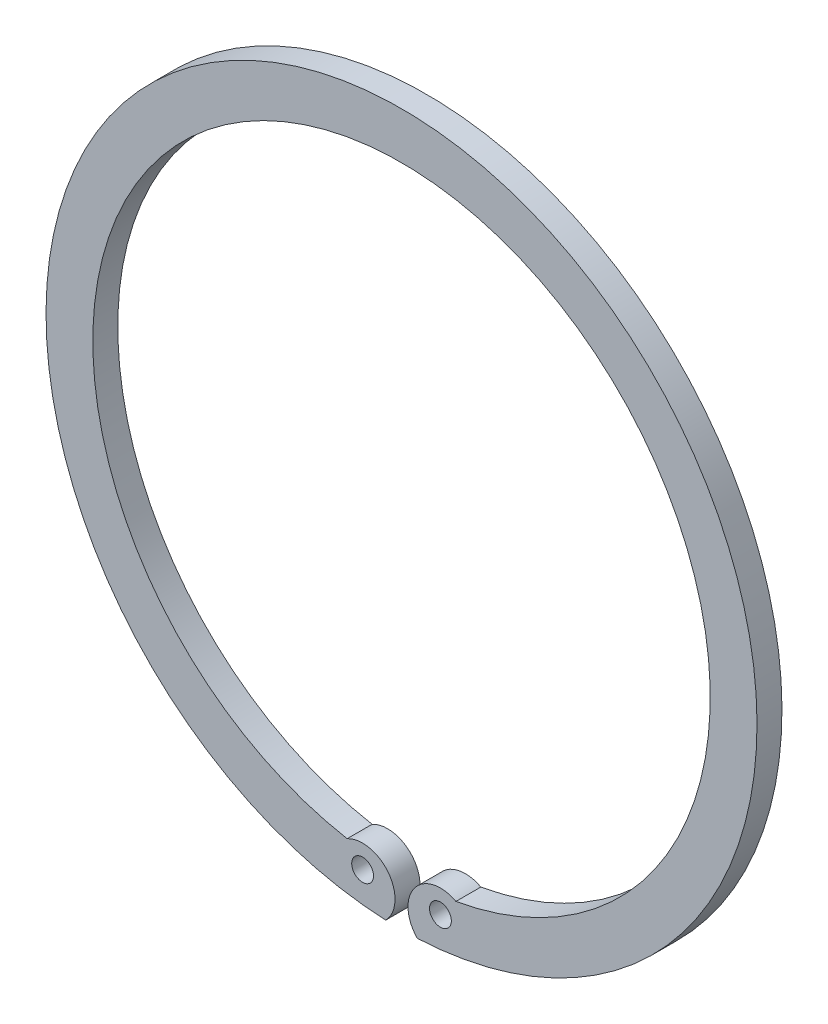
ISO-10303-21;
HEADER;
FILE_DESCRIPTION(('STEP AP214'),'2;1');
FILE_NAME('part.step','',(''),(''),'','','');
FILE_SCHEMA(('AUTOMOTIVE_DESIGN { 1 0 10303 214 1 1 1 1 }'));
ENDSEC;
DATA;
#1=APPLICATION_CONTEXT('core data for automotive mechanical design processes');
#2=APPLICATION_PROTOCOL_DEFINITION('international standard','automotive_design',2000,#1);
#3=PRODUCT_CONTEXT('',#1,'mechanical');
#4=PRODUCT('Part','Part','',(#3));
#5=PRODUCT_RELATED_PRODUCT_CATEGORY('part','',(#4));
#6=PRODUCT_DEFINITION_FORMATION('','',#4);
#7=PRODUCT_DEFINITION_CONTEXT('part definition',#1,'design');
#8=PRODUCT_DEFINITION('design','',#6,#7);
#9=PRODUCT_DEFINITION_SHAPE('','',#8);
#10=(LENGTH_UNIT() NAMED_UNIT(*) SI_UNIT(.MILLI.,.METRE.));
#11=(NAMED_UNIT(*) PLANE_ANGLE_UNIT() SI_UNIT($,.RADIAN.));
#12=(NAMED_UNIT(*) SI_UNIT($,.STERADIAN.) SOLID_ANGLE_UNIT());
#13=UNCERTAINTY_MEASURE_WITH_UNIT(LENGTH_MEASURE(1.E-05),#10,'distance_accuracy_value','');
#14=(GEOMETRIC_REPRESENTATION_CONTEXT(3) GLOBAL_UNCERTAINTY_ASSIGNED_CONTEXT((#13)) GLOBAL_UNIT_ASSIGNED_CONTEXT((#10,
#11,#12)) REPRESENTATION_CONTEXT('',''));
#15=CARTESIAN_POINT('',(0.,0.,0.));
#16=DIRECTION('',(0.,0.,1.));
#17=DIRECTION('',(1.,0.,0.));
#18=AXIS2_PLACEMENT_3D('',#15,#16,#17);
#19=CARTESIAN_POINT('',(6.24,-51.8,2.));
#20=DIRECTION('',(0.,0.,-1.));
#21=DIRECTION('',(1.,0.,0.));
#22=AXIS2_PLACEMENT_3D('',#19,#20,#21);
#23=CYLINDRICAL_SURFACE('',#22,1.75);
#24=CARTESIAN_POINT('',(6.24,-51.8,0.));
#25=DIRECTION('',(0.,0.,1.));
#26=DIRECTION('',(1.,0.,0.));
#27=AXIS2_PLACEMENT_3D('',#24,#25,#26);
#28=CIRCLE('',#27,1.75);
#29=CARTESIAN_POINT('',(4.49,-51.8,0.));
#30=VERTEX_POINT('',#29);
#31=EDGE_CURVE('E33',#30,#30,#28,.T.);
#32=ORIENTED_EDGE('',*,*,#31,.F.);
#33=EDGE_LOOP('',(#32));
#34=FACE_BOUND('',#33,.T.);
#35=CARTESIAN_POINT('',(6.24,-51.8,4.));
#36=DIRECTION('',(0.,0.,-1.));
#37=DIRECTION('',(1.,0.,0.));
#38=AXIS2_PLACEMENT_3D('',#35,#36,#37);
#39=CIRCLE('',#38,1.75);
#40=CARTESIAN_POINT('',(4.49,-51.8,4.));
#41=VERTEX_POINT('',#40);
#42=EDGE_CURVE('E26',#41,#41,#39,.T.);
#43=ORIENTED_EDGE('',*,*,#42,.F.);
#44=EDGE_LOOP('',(#43));
#45=FACE_BOUND('',#44,.T.);
#46=ADVANCED_FACE('F16',(#34,#45),#23,.F.);
#47=CARTESIAN_POINT('',(-6.24,-51.8,2.));
#48=DIRECTION('',(0.,0.,-1.));
#49=DIRECTION('',(1.,0.,0.));
#50=AXIS2_PLACEMENT_3D('',#47,#48,#49);
#51=CYLINDRICAL_SURFACE('',#50,1.75);
#52=CARTESIAN_POINT('',(-6.24,-51.8,0.));
#53=DIRECTION('',(0.,0.,1.));
#54=DIRECTION('',(1.,0.,0.));
#55=AXIS2_PLACEMENT_3D('',#52,#53,#54);
#56=CIRCLE('',#55,1.75);
#57=CARTESIAN_POINT('',(-7.99,-51.8,0.));
#58=VERTEX_POINT('',#57);
#59=EDGE_CURVE('E105',#58,#58,#56,.T.);
#60=ORIENTED_EDGE('',*,*,#59,.F.);
#61=EDGE_LOOP('',(#60));
#62=FACE_BOUND('',#61,.T.);
#63=CARTESIAN_POINT('',(-6.24,-51.8,4.));
#64=DIRECTION('',(0.,0.,-1.));
#65=DIRECTION('',(1.,0.,0.));
#66=AXIS2_PLACEMENT_3D('',#63,#64,#65);
#67=CIRCLE('',#66,1.75);
#68=CARTESIAN_POINT('',(-7.99,-51.8,4.));
#69=VERTEX_POINT('',#68);
#70=EDGE_CURVE('E101',#69,#69,#67,.T.);
#71=ORIENTED_EDGE('',*,*,#70,.F.);
#72=EDGE_LOOP('',(#71));
#73=FACE_BOUND('',#72,.T.);
#74=ADVANCED_FACE('F129',(#62,#73),#51,.F.);
#75=CARTESIAN_POINT('',(6.24,-53.3,2.));
#76=DIRECTION('',(0.,0.,1.));
#77=DIRECTION('',(-1.,0.,0.));
#78=AXIS2_PLACEMENT_3D('',#75,#76,#77);
#79=CYLINDRICAL_SURFACE('',#78,5.2);
#80=DIRECTION('',(0.,0.,1.));
#81=VECTOR('',#80,1.);
#82=CARTESIAN_POINT('',(8.71500065982332,-48.7267766582121,2.));
#83=LINE('',#82,#81);
#84=CARTESIAN_POINT('',(8.71500065982334,-48.7267766582121,0.));
#85=VERTEX_POINT('',#84);
#86=CARTESIAN_POINT('',(8.71500065982332,-48.7267766582121,4.));
#87=VERTEX_POINT('',#86);
#88=EDGE_CURVE('E86',#85,#87,#83,.T.);
#89=ORIENTED_EDGE('',*,*,#88,.F.);
#90=CARTESIAN_POINT('',(6.24,-53.3,0.));
#91=DIRECTION('',(0.,0.,-1.));
#92=DIRECTION('',(-1.,0.,0.));
#93=AXIS2_PLACEMENT_3D('',#90,#91,#92);
#94=CIRCLE('',#93,5.2);
#95=CARTESIAN_POINT('',(2.53020066523321,-56.9438151566406,0.));
#96=VERTEX_POINT('',#95);
#97=EDGE_CURVE('E20',#96,#85,#94,.T.);
#98=ORIENTED_EDGE('',*,*,#97,.F.);
#99=DIRECTION('',(0.,0.,1.));
#100=VECTOR('',#99,1.);
#101=CARTESIAN_POINT('',(2.53020066523321,-56.9438151566406,2.));
#102=LINE('',#101,#100);
#103=CARTESIAN_POINT('',(2.5302006652332,-56.9438151566406,4.));
#104=VERTEX_POINT('',#103);
#105=EDGE_CURVE('E11',#96,#104,#102,.T.);
#106=ORIENTED_EDGE('',*,*,#105,.T.);
#107=CARTESIAN_POINT('',(6.24,-53.3,4.));
#108=DIRECTION('',(0.,0.,1.));
#109=DIRECTION('',(-1.,0.,0.));
#110=AXIS2_PLACEMENT_3D('',#107,#108,#109);
#111=CIRCLE('',#110,5.2);
#112=EDGE_CURVE('E61',#87,#104,#111,.T.);
#113=ORIENTED_EDGE('',*,*,#112,.F.);
#114=EDGE_LOOP('',(#89,#98,#106,#113));
#115=FACE_BOUND('',#114,.T.);
#116=ADVANCED_FACE('F125',(#115),#79,.T.);
#117=CARTESIAN_POINT('',(0.,0.,4.));
#118=DIRECTION('',(0.,0.,1.));
#119=DIRECTION('',(1.,0.,0.));
#120=AXIS2_PLACEMENT_3D('',#117,#118,#119);
#121=PLANE('',#120);
#122=ORIENTED_EDGE('',*,*,#42,.T.);
#123=EDGE_LOOP('',(#122));
#124=FACE_BOUND('',#123,.T.);
#125=ORIENTED_EDGE('',*,*,#70,.T.);
#126=EDGE_LOOP('',(#125));
#127=FACE_BOUND('',#126,.T.);
#128=CARTESIAN_POINT('',(0.,0.,4.));
#129=DIRECTION('',(0.,0.,-1.));
#130=DIRECTION('',(1.,0.,0.));
#131=AXIS2_PLACEMENT_3D('',#128,#129,#130);
#132=CIRCLE('',#131,49.5);
#133=CARTESIAN_POINT('',(-8.71500065982332,-48.7267766582121,4.));
#134=VERTEX_POINT('',#133);
#135=EDGE_CURVE('E83',#134,#87,#132,.T.);
#136=ORIENTED_EDGE('',*,*,#135,.T.);
#137=ORIENTED_EDGE('',*,*,#112,.T.);
#138=CARTESIAN_POINT('',(0.,0.,4.));
#139=DIRECTION('',(0.,0.,1.));
#140=DIRECTION('',(1.,0.,0.));
#141=AXIS2_PLACEMENT_3D('',#138,#139,#140);
#142=CIRCLE('',#141,57.);
#143=CARTESIAN_POINT('',(-2.53020066523321,-56.9438151566406,4.));
#144=VERTEX_POINT('',#143);
#145=EDGE_CURVE('E99',#104,#144,#142,.T.);
#146=ORIENTED_EDGE('',*,*,#145,.T.);
#147=CARTESIAN_POINT('',(-6.24,-53.3,4.));
#148=DIRECTION('',(0.,0.,1.));
#149=DIRECTION('',(1.,0.,0.));
#150=AXIS2_PLACEMENT_3D('',#147,#148,#149);
#151=CIRCLE('',#150,5.2);
#152=EDGE_CURVE('E104',#144,#134,#151,.T.);
#153=ORIENTED_EDGE('',*,*,#152,.T.);
#154=EDGE_LOOP('',(#136,#137,#146,#153));
#155=FACE_BOUND('',#154,.T.);
#156=ADVANCED_FACE('F18',(#124,#127,#155),#121,.T.);
#157=CARTESIAN_POINT('',(0.,0.,2.));
#158=DIRECTION('',(0.,0.,-1.));
#159=DIRECTION('',(1.,0.,0.));
#160=AXIS2_PLACEMENT_3D('',#157,#158,#159);
#161=CYLINDRICAL_SURFACE('',#160,57.);
#162=ORIENTED_EDGE('',*,*,#145,.F.);
#163=ORIENTED_EDGE('',*,*,#105,.F.);
#164=CARTESIAN_POINT('',(0.,0.,0.));
#165=DIRECTION('',(0.,0.,-1.));
#166=DIRECTION('',(-1.,0.,0.));
#167=AXIS2_PLACEMENT_3D('',#164,#165,#166);
#168=CIRCLE('',#167,57.);
#169=CARTESIAN_POINT('',(-2.53020066523321,-56.9438151566406,0.));
#170=VERTEX_POINT('',#169);
#171=EDGE_CURVE('E71',#170,#96,#168,.T.);
#172=ORIENTED_EDGE('',*,*,#171,.F.);
#173=DIRECTION('',(0.,0.,-1.));
#174=VECTOR('',#173,1.);
#175=CARTESIAN_POINT('',(-2.53020066523321,-56.9438151566406,2.));
#176=LINE('',#175,#174);
#177=EDGE_CURVE('E91',#144,#170,#176,.T.);
#178=ORIENTED_EDGE('',*,*,#177,.F.);
#179=EDGE_LOOP('',(#162,#163,#172,#178));
#180=FACE_BOUND('',#179,.T.);
#181=ADVANCED_FACE('F116',(#180),#161,.T.);
#182=CARTESIAN_POINT('',(-6.24,-53.3,2.));
#183=DIRECTION('',(0.,0.,-1.));
#184=DIRECTION('',(1.,0.,0.));
#185=AXIS2_PLACEMENT_3D('',#182,#183,#184);
#186=CYLINDRICAL_SURFACE('',#185,5.2);
#187=DIRECTION('',(0.,0.,-1.));
#188=VECTOR('',#187,1.);
#189=CARTESIAN_POINT('',(-8.71500065982332,-48.7267766582121,2.));
#190=LINE('',#189,#188);
#191=CARTESIAN_POINT('',(-8.71500065982332,-48.7267766582121,0.));
#192=VERTEX_POINT('',#191);
#193=EDGE_CURVE('E78',#134,#192,#190,.T.);
#194=ORIENTED_EDGE('',*,*,#193,.F.);
#195=ORIENTED_EDGE('',*,*,#152,.F.);
#196=ORIENTED_EDGE('',*,*,#177,.T.);
#197=CARTESIAN_POINT('',(-6.24,-53.3,0.));
#198=DIRECTION('',(0.,0.,-1.));
#199=DIRECTION('',(1.,0.,0.));
#200=AXIS2_PLACEMENT_3D('',#197,#198,#199);
#201=CIRCLE('',#200,5.2);
#202=EDGE_CURVE('E89',#192,#170,#201,.T.);
#203=ORIENTED_EDGE('',*,*,#202,.F.);
#204=EDGE_LOOP('',(#194,#195,#196,#203));
#205=FACE_BOUND('',#204,.T.);
#206=ADVANCED_FACE('F90',(#205),#186,.T.);
#207=CARTESIAN_POINT('',(0.,0.,0.));
#208=DIRECTION('',(0.,0.,-1.));
#209=DIRECTION('',(-1.,0.,0.));
#210=AXIS2_PLACEMENT_3D('',#207,#208,#209);
#211=PLANE('',#210);
#212=ORIENTED_EDGE('',*,*,#31,.T.);
#213=EDGE_LOOP('',(#212));
#214=FACE_BOUND('',#213,.T.);
#215=ORIENTED_EDGE('',*,*,#59,.T.);
#216=EDGE_LOOP('',(#215));
#217=FACE_BOUND('',#216,.T.);
#218=ORIENTED_EDGE('',*,*,#171,.T.);
#219=ORIENTED_EDGE('',*,*,#97,.T.);
#220=CARTESIAN_POINT('',(0.,0.,0.));
#221=DIRECTION('',(0.,0.,1.));
#222=DIRECTION('',(1.,0.,0.));
#223=AXIS2_PLACEMENT_3D('',#220,#221,#222);
#224=CIRCLE('',#223,49.5);
#225=EDGE_CURVE('E82',#85,#192,#224,.T.);
#226=ORIENTED_EDGE('',*,*,#225,.T.);
#227=ORIENTED_EDGE('',*,*,#202,.T.);
#228=EDGE_LOOP('',(#218,#219,#226,#227));
#229=FACE_BOUND('',#228,.T.);
#230=ADVANCED_FACE('F94',(#214,#217,#229),#211,.T.);
#231=CARTESIAN_POINT('',(0.,0.,-4.));
#232=DIRECTION('',(0.,0.,-1.));
#233=DIRECTION('',(1.,0.,0.));
#234=AXIS2_PLACEMENT_3D('',#231,#232,#233);
#235=CYLINDRICAL_SURFACE('',#234,49.5);
#236=ORIENTED_EDGE('',*,*,#88,.T.);
#237=ORIENTED_EDGE('',*,*,#135,.F.);
#238=ORIENTED_EDGE('',*,*,#193,.T.);
#239=ORIENTED_EDGE('',*,*,#225,.F.);
#240=EDGE_LOOP('',(#236,#237,#238,#239));
#241=FACE_BOUND('',#240,.T.);
#242=ADVANCED_FACE('F80',(#241),#235,.F.);
#243=CLOSED_SHELL('',(#46,#74,#116,#156,#181,#206,#230,#242));
#244=MANIFOLD_SOLID_BREP('B1',#243);
#245=ADVANCED_BREP_SHAPE_REPRESENTATION('',(#18,#244),#14);
#246=SHAPE_DEFINITION_REPRESENTATION(#9,#245);
ENDSEC;
END-ISO-10303-21;
